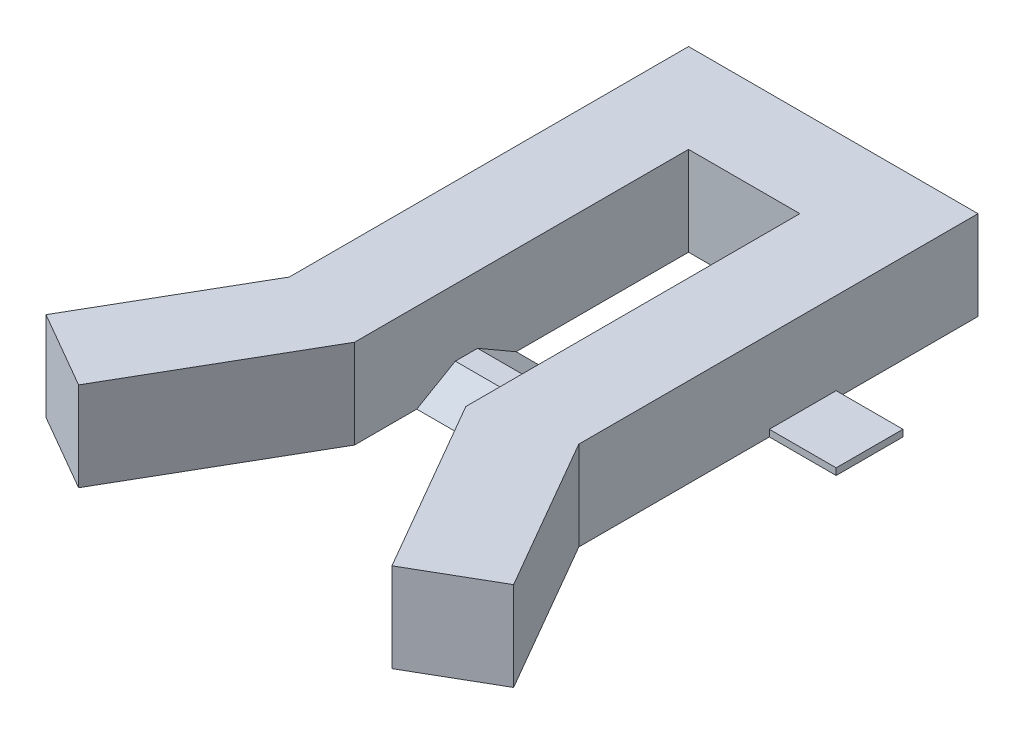
ISO-10303-21;
HEADER;
FILE_DESCRIPTION(('STEP AP214'),'2;1');
FILE_NAME('part.step','',(''),(''),'','','');
FILE_SCHEMA(('AUTOMOTIVE_DESIGN { 1 0 10303 214 1 1 1 1 }'));
ENDSEC;
DATA;
#1=APPLICATION_CONTEXT('core data for automotive mechanical design processes');
#2=APPLICATION_PROTOCOL_DEFINITION('international standard','automotive_design',2000,#1);
#3=PRODUCT_CONTEXT('',#1,'mechanical');
#4=PRODUCT('Part','Part','',(#3));
#5=PRODUCT_RELATED_PRODUCT_CATEGORY('part','',(#4));
#6=PRODUCT_DEFINITION_FORMATION('','',#4);
#7=PRODUCT_DEFINITION_CONTEXT('part definition',#1,'design');
#8=PRODUCT_DEFINITION('design','',#6,#7);
#9=PRODUCT_DEFINITION_SHAPE('','',#8);
#10=(LENGTH_UNIT() NAMED_UNIT(*) SI_UNIT(.MILLI.,.METRE.));
#11=(NAMED_UNIT(*) PLANE_ANGLE_UNIT() SI_UNIT($,.RADIAN.));
#12=(NAMED_UNIT(*) SI_UNIT($,.STERADIAN.) SOLID_ANGLE_UNIT());
#13=UNCERTAINTY_MEASURE_WITH_UNIT(LENGTH_MEASURE(1.E-05),#10,'distance_accuracy_value','');
#14=(GEOMETRIC_REPRESENTATION_CONTEXT(3) GLOBAL_UNCERTAINTY_ASSIGNED_CONTEXT((#13)) GLOBAL_UNIT_ASSIGNED_CONTEXT((#10,
#11,#12)) REPRESENTATION_CONTEXT('',''));
#15=CARTESIAN_POINT('',(0.,0.,0.));
#16=DIRECTION('',(0.,0.,1.));
#17=DIRECTION('',(1.,0.,0.));
#18=AXIS2_PLACEMENT_3D('',#15,#16,#17);
#19=CARTESIAN_POINT('',(-12.5,20.,-75.));
#20=DIRECTION('',(-1.,0.,0.));
#21=DIRECTION('',(0.,0.,1.));
#22=AXIS2_PLACEMENT_3D('',#19,#20,#21);
#23=PLANE('',#22);
#24=DIRECTION('',(0.,0.499999999999994,-0.866025403784442));
#25=VECTOR('',#24,1.);
#26=CARTESIAN_POINT('',(-12.5,5.,-22.6313972081441));
#27=LINE('',#26,#25);
#28=CARTESIAN_POINT('',(-12.5,0.,-13.9711431702996));
#29=VERTEX_POINT('',#28);
#30=CARTESIAN_POINT('',(-12.5,5.,-22.6313972081441));
#31=VERTEX_POINT('',#30);
#32=EDGE_CURVE('E311',#29,#31,#27,.T.);
#33=ORIENTED_EDGE('',*,*,#32,.T.);
#34=DIRECTION('',(0.,0.,-1.));
#35=VECTOR('',#34,1.);
#36=CARTESIAN_POINT('',(-12.5,5.,-27.6313972081441));
#37=LINE('',#36,#35);
#38=CARTESIAN_POINT('',(-12.5,5.00000000000001,-27.6313972081441));
#39=VERTEX_POINT('',#38);
#40=EDGE_CURVE('E307',#31,#39,#37,.T.);
#41=ORIENTED_EDGE('',*,*,#40,.T.);
#42=DIRECTION('',(0.,-0.499999999999995,-0.866025403784441));
#43=VECTOR('',#42,1.);
#44=CARTESIAN_POINT('',(-12.5,0.,-36.2916512459886));
#45=LINE('',#44,#43);
#46=CARTESIAN_POINT('',(-12.5,0.,-36.2916512459886));
#47=VERTEX_POINT('',#46);
#48=EDGE_CURVE('E296',#39,#47,#45,.T.);
#49=ORIENTED_EDGE('',*,*,#48,.T.);
#50=DIRECTION('',(0.,0.,-1.));
#51=VECTOR('',#50,1.);
#52=CARTESIAN_POINT('',(-12.5,0.,-75.));
#53=LINE('',#52,#51);
#54=CARTESIAN_POINT('',(-12.5,0.,-75.));
#55=VERTEX_POINT('',#54);
#56=EDGE_CURVE('E418',#47,#55,#53,.T.);
#57=ORIENTED_EDGE('',*,*,#56,.T.);
#58=DIRECTION('',(0.,-1.,0.));
#59=VECTOR('',#58,1.);
#60=CARTESIAN_POINT('',(-12.5,20.,-75.));
#61=LINE('',#60,#59);
#62=CARTESIAN_POINT('',(-12.5,20.,-75.));
#63=VERTEX_POINT('',#62);
#64=EDGE_CURVE('E446',#63,#55,#61,.T.);
#65=ORIENTED_EDGE('',*,*,#64,.F.);
#66=DIRECTION('',(0.,0.,-1.));
#67=VECTOR('',#66,1.);
#68=CARTESIAN_POINT('',(-12.5,20.,-75.));
#69=LINE('',#68,#67);
#70=CARTESIAN_POINT('',(-12.5,20.,0.));
#71=VERTEX_POINT('',#70);
#72=EDGE_CURVE('E396',#71,#63,#69,.T.);
#73=ORIENTED_EDGE('',*,*,#72,.F.);
#74=DIRECTION('',(0.,-1.,0.));
#75=VECTOR('',#74,1.);
#76=CARTESIAN_POINT('',(-12.5,20.,0.));
#77=LINE('',#76,#75);
#78=CARTESIAN_POINT('',(-12.5,0.,0.));
#79=VERTEX_POINT('',#78);
#80=EDGE_CURVE('E54',#71,#79,#77,.T.);
#81=ORIENTED_EDGE('',*,*,#80,.T.);
#82=EDGE_CURVE('E419',#79,#29,#53,.T.);
#83=ORIENTED_EDGE('',*,*,#82,.T.);
#84=EDGE_LOOP('',(#33,#41,#49,#57,#65,#73,#81,#83));
#85=FACE_BOUND('',#84,.T.);
#86=ADVANCED_FACE('F45',(#85),#23,.F.);
#87=CARTESIAN_POINT('',(12.5,20.,-75.));
#88=DIRECTION('',(-1.,0.,0.));
#89=DIRECTION('',(0.,0.,1.));
#90=AXIS2_PLACEMENT_3D('',#87,#88,#89);
#91=PLANE('',#90);
#92=DIRECTION('',(0.,0.,-1.));
#93=VECTOR('',#92,1.);
#94=CARTESIAN_POINT('',(12.5,5.,-27.6313972081441));
#95=LINE('',#94,#93);
#96=CARTESIAN_POINT('',(12.5,5.,-22.6313972081441));
#97=VERTEX_POINT('',#96);
#98=CARTESIAN_POINT('',(12.5,5.,-27.6313972081441));
#99=VERTEX_POINT('',#98);
#100=EDGE_CURVE('E298',#97,#99,#95,.T.);
#101=ORIENTED_EDGE('',*,*,#100,.F.);
#102=DIRECTION('',(0.,0.499999999999994,-0.866025403784442));
#103=VECTOR('',#102,1.);
#104=CARTESIAN_POINT('',(12.5,5.,-22.6313972081441));
#105=LINE('',#104,#103);
#106=CARTESIAN_POINT('',(12.5,0.,-13.9711431702996));
#107=VERTEX_POINT('',#106);
#108=EDGE_CURVE('E302',#107,#97,#105,.T.);
#109=ORIENTED_EDGE('',*,*,#108,.F.);
#110=DIRECTION('',(0.,0.,-1.));
#111=VECTOR('',#110,1.);
#112=CARTESIAN_POINT('',(12.5,0.,-75.));
#113=LINE('',#112,#111);
#114=CARTESIAN_POINT('',(12.5,0.,0.));
#115=VERTEX_POINT('',#114);
#116=EDGE_CURVE('E360',#115,#107,#113,.T.);
#117=ORIENTED_EDGE('',*,*,#116,.F.);
#118=DIRECTION('',(0.,-1.,0.));
#119=VECTOR('',#118,1.);
#120=CARTESIAN_POINT('',(12.5,20.,0.));
#121=LINE('',#120,#119);
#122=CARTESIAN_POINT('',(12.5,20.,0.));
#123=VERTEX_POINT('',#122);
#124=EDGE_CURVE('E369',#123,#115,#121,.T.);
#125=ORIENTED_EDGE('',*,*,#124,.F.);
#126=DIRECTION('',(0.,0.,-1.));
#127=VECTOR('',#126,1.);
#128=CARTESIAN_POINT('',(12.5,20.,-75.));
#129=LINE('',#128,#127);
#130=CARTESIAN_POINT('',(12.5,20.,-75.));
#131=VERTEX_POINT('',#130);
#132=EDGE_CURVE('E339',#123,#131,#129,.T.);
#133=ORIENTED_EDGE('',*,*,#132,.T.);
#134=DIRECTION('',(0.,-1.,0.));
#135=VECTOR('',#134,1.);
#136=CARTESIAN_POINT('',(12.5,20.,-75.));
#137=LINE('',#136,#135);
#138=CARTESIAN_POINT('',(12.5,0.,-75.));
#139=VERTEX_POINT('',#138);
#140=EDGE_CURVE('E372',#131,#139,#137,.T.);
#141=ORIENTED_EDGE('',*,*,#140,.T.);
#142=CARTESIAN_POINT('',(12.5,0.,-36.2916512459886));
#143=VERTEX_POINT('',#142);
#144=EDGE_CURVE('E359',#143,#139,#113,.T.);
#145=ORIENTED_EDGE('',*,*,#144,.F.);
#146=DIRECTION('',(0.,-0.499999999999995,-0.866025403784441));
#147=VECTOR('',#146,1.);
#148=CARTESIAN_POINT('',(12.5,0.,-36.2916512459886));
#149=LINE('',#148,#147);
#150=EDGE_CURVE('E292',#99,#143,#149,.T.);
#151=ORIENTED_EDGE('',*,*,#150,.F.);
#152=EDGE_LOOP('',(#101,#109,#117,#125,#133,#141,#145,#151));
#153=FACE_BOUND('',#152,.T.);
#154=ADVANCED_FACE('F466',(#153),#91,.T.);
#155=CARTESIAN_POINT('',(-52.4999999999998,20.,29.2820323027553));
#156=DIRECTION('',(0.499999999999994,0.,-0.866025403784442));
#157=DIRECTION('',(-0.866025403784442,0.,-0.499999999999994));
#158=AXIS2_PLACEMENT_3D('',#155,#156,#157);
#159=PLANE('',#158);
#160=DIRECTION('',(0.866025403784442,0.,0.499999999999994));
#161=VECTOR('',#160,1.);
#162=CARTESIAN_POINT('',(-52.4999999999998,0.,29.2820323027553));
#163=LINE('',#162,#161);
#164=CARTESIAN_POINT('',(-52.4999999999998,0.,29.2820323027553));
#165=VERTEX_POINT('',#164);
#166=CARTESIAN_POINT('',(-35.1794919243109,0.,39.2820323027552));
#167=VERTEX_POINT('',#166);
#168=EDGE_CURVE('E387',#165,#167,#163,.T.);
#169=ORIENTED_EDGE('',*,*,#168,.T.);
#170=DIRECTION('',(0.,-1.,0.));
#171=VECTOR('',#170,1.);
#172=CARTESIAN_POINT('',(-35.1794919243109,20.,39.2820323027552));
#173=LINE('',#172,#171);
#174=CARTESIAN_POINT('',(-35.1794919243109,20.,39.2820323027552));
#175=VERTEX_POINT('',#174);
#176=EDGE_CURVE('E11',#175,#167,#173,.T.);
#177=ORIENTED_EDGE('',*,*,#176,.F.);
#178=DIRECTION('',(0.866025403784442,0.,0.499999999999994));
#179=VECTOR('',#178,1.);
#180=CARTESIAN_POINT('',(-52.4999999999998,20.,29.2820323027553));
#181=LINE('',#180,#179);
#182=CARTESIAN_POINT('',(-52.4999999999998,20.,29.2820323027553));
#183=VERTEX_POINT('',#182);
#184=EDGE_CURVE('E388',#183,#175,#181,.T.);
#185=ORIENTED_EDGE('',*,*,#184,.F.);
#186=DIRECTION('',(0.,-1.,0.));
#187=VECTOR('',#186,1.);
#188=CARTESIAN_POINT('',(-52.4999999999998,20.,29.2820323027553));
#189=LINE('',#188,#187);
#190=EDGE_CURVE('E411',#183,#165,#189,.T.);
#191=ORIENTED_EDGE('',*,*,#190,.T.);
#192=EDGE_LOOP('',(#169,#177,#185,#191));
#193=FACE_BOUND('',#192,.T.);
#194=ADVANCED_FACE('F47',(#193),#159,.F.);
#195=CARTESIAN_POINT('',(-35.1794919243109,20.,39.2820323027552));
#196=DIRECTION('',(-0.866025403784442,0.,-0.499999999999994));
#197=DIRECTION('',(-0.499999999999994,0.,0.866025403784442));
#198=AXIS2_PLACEMENT_3D('',#195,#196,#197);
#199=PLANE('',#198);
#200=DIRECTION('',(0.499999999999994,0.,-0.866025403784442));
#201=VECTOR('',#200,1.);
#202=CARTESIAN_POINT('',(-35.1794919243109,0.,39.2820323027552));
#203=LINE('',#202,#201);
#204=EDGE_CURVE('E415',#167,#79,#203,.T.);
#205=ORIENTED_EDGE('',*,*,#204,.T.);
#206=ORIENTED_EDGE('',*,*,#80,.F.);
#207=DIRECTION('',(0.499999999999994,0.,-0.866025403784442));
#208=VECTOR('',#207,1.);
#209=CARTESIAN_POINT('',(-35.1794919243109,20.,39.2820323027552));
#210=LINE('',#209,#208);
#211=EDGE_CURVE('E392',#175,#71,#210,.T.);
#212=ORIENTED_EDGE('',*,*,#211,.F.);
#213=ORIENTED_EDGE('',*,*,#176,.T.);
#214=EDGE_LOOP('',(#205,#206,#212,#213));
#215=FACE_BOUND('',#214,.T.);
#216=ADVANCED_FACE('F506',(#215),#199,.F.);
#217=CARTESIAN_POINT('',(0.,20.,-75.));
#218=DIRECTION('',(0.,0.,-1.));
#219=DIRECTION('',(-1.,0.,0.));
#220=AXIS2_PLACEMENT_3D('',#217,#218,#219);
#221=PLANE('',#220);
#222=DIRECTION('',(1.,0.,0.));
#223=VECTOR('',#222,1.);
#224=CARTESIAN_POINT('',(0.,0.,-75.));
#225=LINE('',#224,#223);
#226=EDGE_CURVE('E422',#55,#139,#225,.T.);
#227=ORIENTED_EDGE('',*,*,#226,.T.);
#228=ORIENTED_EDGE('',*,*,#140,.F.);
#229=DIRECTION('',(1.,0.,0.));
#230=VECTOR('',#229,1.);
#231=CARTESIAN_POINT('',(0.,20.,-75.));
#232=LINE('',#231,#230);
#233=EDGE_CURVE('E399',#63,#131,#232,.T.);
#234=ORIENTED_EDGE('',*,*,#233,.F.);
#235=ORIENTED_EDGE('',*,*,#64,.T.);
#236=EDGE_LOOP('',(#227,#228,#234,#235));
#237=FACE_BOUND('',#236,.T.);
#238=ADVANCED_FACE('F481',(#237),#221,.F.);
#239=CARTESIAN_POINT('',(-32.5,20.,-95.));
#240=DIRECTION('',(0.,0.,1.));
#241=DIRECTION('',(1.,0.,0.));
#242=AXIS2_PLACEMENT_3D('',#239,#240,#241);
#243=PLANE('',#242);
#244=DIRECTION('',(-1.,0.,0.));
#245=VECTOR('',#244,1.);
#246=CARTESIAN_POINT('',(-32.5,0.,-95.));
#247=LINE('',#246,#245);
#248=CARTESIAN_POINT('',(32.5,0.,-95.));
#249=VERTEX_POINT('',#248);
#250=CARTESIAN_POINT('',(-32.5,0.,-95.));
#251=VERTEX_POINT('',#250);
#252=EDGE_CURVE('E426',#249,#251,#247,.T.);
#253=ORIENTED_EDGE('',*,*,#252,.T.);
#254=DIRECTION('',(0.,-1.,0.));
#255=VECTOR('',#254,1.);
#256=CARTESIAN_POINT('',(-32.5,20.,-95.));
#257=LINE('',#256,#255);
#258=CARTESIAN_POINT('',(-32.5,20.,-95.));
#259=VERTEX_POINT('',#258);
#260=EDGE_CURVE('E442',#259,#251,#257,.T.);
#261=ORIENTED_EDGE('',*,*,#260,.F.);
#262=DIRECTION('',(-1.,0.,0.));
#263=VECTOR('',#262,1.);
#264=CARTESIAN_POINT('',(-32.5,20.,-95.));
#265=LINE('',#264,#263);
#266=CARTESIAN_POINT('',(32.5,20.,-95.));
#267=VERTEX_POINT('',#266);
#268=EDGE_CURVE('E402',#267,#259,#265,.T.);
#269=ORIENTED_EDGE('',*,*,#268,.F.);
#270=DIRECTION('',(0.,-1.,0.));
#271=VECTOR('',#270,1.);
#272=CARTESIAN_POINT('',(32.5,20.,-95.));
#273=LINE('',#272,#271);
#274=EDGE_CURVE('E376',#267,#249,#273,.T.);
#275=ORIENTED_EDGE('',*,*,#274,.T.);
#276=EDGE_LOOP('',(#253,#261,#269,#275));
#277=FACE_BOUND('',#276,.T.);
#278=ADVANCED_FACE('F555',(#277),#243,.F.);
#279=CARTESIAN_POINT('',(-32.5,20.,-95.));
#280=DIRECTION('',(1.,0.,0.));
#281=DIRECTION('',(0.,0.,-1.));
#282=AXIS2_PLACEMENT_3D('',#279,#280,#281);
#283=PLANE('',#282);
#284=DIRECTION('',(0.,0.,1.));
#285=VECTOR('',#284,1.);
#286=CARTESIAN_POINT('',(-32.5,0.,-95.));
#287=LINE('',#286,#285);
#288=CARTESIAN_POINT('',(-32.5,0.,-63.1458256229943));
#289=VERTEX_POINT('',#288);
#290=EDGE_CURVE('E430',#251,#289,#287,.T.);
#291=ORIENTED_EDGE('',*,*,#290,.T.);
#292=DIRECTION('',(0.,-1.,0.));
#293=VECTOR('',#292,1.);
#294=CARTESIAN_POINT('',(-32.5,1.5,-63.1458256229943));
#295=LINE('',#294,#293);
#296=CARTESIAN_POINT('',(-32.5,1.5,-63.1458256229943));
#297=VERTEX_POINT('',#296);
#298=EDGE_CURVE('E279',#297,#289,#295,.T.);
#299=ORIENTED_EDGE('',*,*,#298,.F.);
#300=DIRECTION('',(0.,0.,1.));
#301=VECTOR('',#300,1.);
#302=CARTESIAN_POINT('',(-32.5,1.5,-48.1458256229943));
#303=LINE('',#302,#301);
#304=CARTESIAN_POINT('',(-32.5,1.5,-48.1458256229943));
#305=VERTEX_POINT('',#304);
#306=EDGE_CURVE('E69',#297,#305,#303,.T.);
#307=ORIENTED_EDGE('',*,*,#306,.T.);
#308=DIRECTION('',(0.,-1.,0.));
#309=VECTOR('',#308,1.);
#310=CARTESIAN_POINT('',(-32.5,1.5,-48.1458256229943));
#311=LINE('',#310,#309);
#312=CARTESIAN_POINT('',(-32.5,0.,-48.1458256229943));
#313=VERTEX_POINT('',#312);
#314=EDGE_CURVE('E268',#305,#313,#311,.T.);
#315=ORIENTED_EDGE('',*,*,#314,.T.);
#316=CARTESIAN_POINT('',(-32.5,0.,-5.35898384862239));
#317=VERTEX_POINT('',#316);
#318=EDGE_CURVE('E429',#313,#317,#287,.T.);
#319=ORIENTED_EDGE('',*,*,#318,.T.);
#320=DIRECTION('',(0.,-1.,0.));
#321=VECTOR('',#320,1.);
#322=CARTESIAN_POINT('',(-32.5,20.,-5.35898384862239));
#323=LINE('',#322,#321);
#324=CARTESIAN_POINT('',(-32.5,20.,-5.35898384862239));
#325=VERTEX_POINT('',#324);
#326=EDGE_CURVE('E438',#325,#317,#323,.T.);
#327=ORIENTED_EDGE('',*,*,#326,.F.);
#328=DIRECTION('',(0.,0.,1.));
#329=VECTOR('',#328,1.);
#330=CARTESIAN_POINT('',(-32.5,20.,-95.));
#331=LINE('',#330,#329);
#332=EDGE_CURVE('E405',#259,#325,#331,.T.);
#333=ORIENTED_EDGE('',*,*,#332,.F.);
#334=ORIENTED_EDGE('',*,*,#260,.T.);
#335=EDGE_LOOP('',(#291,#299,#307,#315,#319,#327,#333,#334));
#336=FACE_BOUND('',#335,.T.);
#337=ADVANCED_FACE('F515',(#336),#283,.F.);
#338=CARTESIAN_POINT('',(-32.5,20.,-5.35898384862239));
#339=DIRECTION('',(0.866025403784442,0.,0.499999999999995));
#340=DIRECTION('',(0.499999999999995,0.,-0.866025403784442));
#341=AXIS2_PLACEMENT_3D('',#338,#339,#340);
#342=PLANE('',#341);
#343=DIRECTION('',(-0.499999999999995,0.,0.866025403784442));
#344=VECTOR('',#343,1.);
#345=CARTESIAN_POINT('',(-32.5,0.,-5.35898384862239));
#346=LINE('',#345,#344);
#347=EDGE_CURVE('E393',#317,#165,#346,.T.);
#348=ORIENTED_EDGE('',*,*,#347,.T.);
#349=ORIENTED_EDGE('',*,*,#190,.F.);
#350=DIRECTION('',(-0.499999999999995,0.,0.866025403784442));
#351=VECTOR('',#350,1.);
#352=CARTESIAN_POINT('',(-32.5,20.,-5.35898384862239));
#353=LINE('',#352,#351);
#354=EDGE_CURVE('E408',#325,#183,#353,.T.);
#355=ORIENTED_EDGE('',*,*,#354,.F.);
#356=ORIENTED_EDGE('',*,*,#326,.T.);
#357=EDGE_LOOP('',(#348,#349,#355,#356));
#358=FACE_BOUND('',#357,.T.);
#359=ADVANCED_FACE('F511',(#358),#342,.F.);
#360=CARTESIAN_POINT('',(0.,20.,0.));
#361=DIRECTION('',(0.,1.,0.));
#362=DIRECTION('',(0.,0.,1.));
#363=AXIS2_PLACEMENT_3D('',#360,#361,#362);
#364=PLANE('',#363);
#365=ORIENTED_EDGE('',*,*,#184,.T.);
#366=ORIENTED_EDGE('',*,*,#211,.T.);
#367=ORIENTED_EDGE('',*,*,#72,.T.);
#368=ORIENTED_EDGE('',*,*,#233,.T.);
#369=ORIENTED_EDGE('',*,*,#132,.F.);
#370=DIRECTION('',(-0.499999999999994,0.,-0.866025403784442));
#371=VECTOR('',#370,1.);
#372=CARTESIAN_POINT('',(35.1794919243109,20.,39.2820323027552));
#373=LINE('',#372,#371);
#374=CARTESIAN_POINT('',(35.1794919243109,20.,39.2820323027552));
#375=VERTEX_POINT('',#374);
#376=EDGE_CURVE('E343',#375,#123,#373,.T.);
#377=ORIENTED_EDGE('',*,*,#376,.F.);
#378=DIRECTION('',(-0.866025403784442,0.,0.499999999999994));
#379=VECTOR('',#378,1.);
#380=CARTESIAN_POINT('',(52.4999999999998,20.,29.2820323027553));
#381=LINE('',#380,#379);
#382=CARTESIAN_POINT('',(52.4999999999998,20.,29.2820323027553));
#383=VERTEX_POINT('',#382);
#384=EDGE_CURVE('E326',#383,#375,#381,.T.);
#385=ORIENTED_EDGE('',*,*,#384,.F.);
#386=DIRECTION('',(0.499999999999995,0.,0.866025403784442));
#387=VECTOR('',#386,1.);
#388=CARTESIAN_POINT('',(32.5,20.,-5.35898384862239));
#389=LINE('',#388,#387);
#390=CARTESIAN_POINT('',(32.5,20.,-5.35898384862239));
#391=VERTEX_POINT('',#390);
#392=EDGE_CURVE('E330',#391,#383,#389,.T.);
#393=ORIENTED_EDGE('',*,*,#392,.F.);
#394=DIRECTION('',(0.,0.,1.));
#395=VECTOR('',#394,1.);
#396=CARTESIAN_POINT('',(32.5,20.,-95.));
#397=LINE('',#396,#395);
#398=EDGE_CURVE('E335',#267,#391,#397,.T.);
#399=ORIENTED_EDGE('',*,*,#398,.F.);
#400=ORIENTED_EDGE('',*,*,#268,.T.);
#401=ORIENTED_EDGE('',*,*,#332,.T.);
#402=ORIENTED_EDGE('',*,*,#354,.T.);
#403=EDGE_LOOP('',(#365,#366,#367,#368,#369,#377,#385,#393,#399,#400,#401,#402));
#404=FACE_BOUND('',#403,.T.);
#405=ADVANCED_FACE('F503',(#404),#364,.T.);
#406=CARTESIAN_POINT('',(0.,0.,0.));
#407=DIRECTION('',(0.,1.,0.));
#408=DIRECTION('',(0.,0.,1.));
#409=AXIS2_PLACEMENT_3D('',#406,#407,#408);
#410=PLANE('',#409);
#411=DIRECTION('',(1.,0.,0.));
#412=VECTOR('',#411,1.);
#413=CARTESIAN_POINT('',(-35.3736765902838,0.,-13.9711431702996));
#414=LINE('',#413,#412);
#415=EDGE_CURVE('E306',#29,#107,#414,.T.);
#416=ORIENTED_EDGE('',*,*,#415,.F.);
#417=ORIENTED_EDGE('',*,*,#82,.F.);
#418=ORIENTED_EDGE('',*,*,#204,.F.);
#419=ORIENTED_EDGE('',*,*,#168,.F.);
#420=ORIENTED_EDGE('',*,*,#347,.F.);
#421=ORIENTED_EDGE('',*,*,#318,.F.);
#422=DIRECTION('',(-1.,0.,0.));
#423=VECTOR('',#422,1.);
#424=CARTESIAN_POINT('',(-32.5,0.,-48.1458256229943));
#425=LINE('',#424,#423);
#426=CARTESIAN_POINT('',(-47.5,0.,-48.1458256229943));
#427=VERTEX_POINT('',#426);
#428=EDGE_CURVE('E243',#313,#427,#425,.T.);
#429=ORIENTED_EDGE('',*,*,#428,.T.);
#430=DIRECTION('',(0.,0.,-1.));
#431=VECTOR('',#430,1.);
#432=CARTESIAN_POINT('',(-47.5,0.,-48.1458256229943));
#433=LINE('',#432,#431);
#434=CARTESIAN_POINT('',(-47.5,0.,-63.1458256229943));
#435=VERTEX_POINT('',#434);
#436=EDGE_CURVE('E272',#427,#435,#433,.T.);
#437=ORIENTED_EDGE('',*,*,#436,.T.);
#438=DIRECTION('',(1.,0.,0.));
#439=VECTOR('',#438,1.);
#440=CARTESIAN_POINT('',(-32.5,0.,-63.1458256229943));
#441=LINE('',#440,#439);
#442=EDGE_CURVE('E256',#435,#289,#441,.T.);
#443=ORIENTED_EDGE('',*,*,#442,.T.);
#444=ORIENTED_EDGE('',*,*,#290,.F.);
#445=ORIENTED_EDGE('',*,*,#252,.F.);
#446=DIRECTION('',(0.,0.,1.));
#447=VECTOR('',#446,1.);
#448=CARTESIAN_POINT('',(32.5,0.,-95.));
#449=LINE('',#448,#447);
#450=CARTESIAN_POINT('',(32.5,0.,-63.1458256229943));
#451=VERTEX_POINT('',#450);
#452=EDGE_CURVE('E356',#249,#451,#449,.T.);
#453=ORIENTED_EDGE('',*,*,#452,.T.);
#454=DIRECTION('',(1.,0.,0.));
#455=VECTOR('',#454,1.);
#456=CARTESIAN_POINT('',(32.5,0.,-63.1458256229943));
#457=LINE('',#456,#455);
#458=CARTESIAN_POINT('',(47.5,0.,-63.1458256229943));
#459=VERTEX_POINT('',#458);
#460=EDGE_CURVE('E226',#451,#459,#457,.T.);
#461=ORIENTED_EDGE('',*,*,#460,.T.);
#462=DIRECTION('',(0.,0.,1.));
#463=VECTOR('',#462,1.);
#464=CARTESIAN_POINT('',(47.5,0.,-48.1458256229943));
#465=LINE('',#464,#463);
#466=CARTESIAN_POINT('',(47.5,0.,-48.1458256229943));
#467=VERTEX_POINT('',#466);
#468=EDGE_CURVE('E211',#459,#467,#465,.T.);
#469=ORIENTED_EDGE('',*,*,#468,.T.);
#470=DIRECTION('',(-1.,0.,0.));
#471=VECTOR('',#470,1.);
#472=CARTESIAN_POINT('',(32.5,0.,-48.1458256229943));
#473=LINE('',#472,#471);
#474=CARTESIAN_POINT('',(32.5,0.,-48.1458256229943));
#475=VERTEX_POINT('',#474);
#476=EDGE_CURVE('E61',#467,#475,#473,.T.);
#477=ORIENTED_EDGE('',*,*,#476,.T.);
#478=CARTESIAN_POINT('',(32.5,0.,-5.35898384862239));
#479=VERTEX_POINT('',#478);
#480=EDGE_CURVE('E355',#475,#479,#449,.T.);
#481=ORIENTED_EDGE('',*,*,#480,.T.);
#482=DIRECTION('',(0.499999999999995,0.,0.866025403784442));
#483=VECTOR('',#482,1.);
#484=CARTESIAN_POINT('',(32.5,0.,-5.35898384862239));
#485=LINE('',#484,#483);
#486=CARTESIAN_POINT('',(52.4999999999998,0.,29.2820323027553));
#487=VERTEX_POINT('',#486);
#488=EDGE_CURVE('E351',#479,#487,#485,.T.);
#489=ORIENTED_EDGE('',*,*,#488,.T.);
#490=DIRECTION('',(-0.866025403784442,0.,0.499999999999994));
#491=VECTOR('',#490,1.);
#492=CARTESIAN_POINT('',(52.4999999999998,0.,29.2820323027553));
#493=LINE('',#492,#491);
#494=CARTESIAN_POINT('',(35.1794919243109,0.,39.2820323027552));
#495=VERTEX_POINT('',#494);
#496=EDGE_CURVE('E310',#487,#495,#493,.T.);
#497=ORIENTED_EDGE('',*,*,#496,.T.);
#498=DIRECTION('',(-0.499999999999994,0.,-0.866025403784442));
#499=VECTOR('',#498,1.);
#500=CARTESIAN_POINT('',(35.1794919243109,0.,39.2820323027552));
#501=LINE('',#500,#499);
#502=EDGE_CURVE('E331',#495,#115,#501,.T.);
#503=ORIENTED_EDGE('',*,*,#502,.T.);
#504=ORIENTED_EDGE('',*,*,#116,.T.);
#505=EDGE_LOOP('',(#416,#417,#418,#419,#420,#421,#429,#437,#443,#444,#445,#453,#461,#469,#477,
#481,#489,#497,#503,#504));
#506=FACE_BOUND('',#505,.T.);
#507=ORIENTED_EDGE('',*,*,#56,.F.);
#508=DIRECTION('',(1.,0.,0.));
#509=VECTOR('',#508,1.);
#510=CARTESIAN_POINT('',(-35.3736765902838,0.,-36.2916512459886));
#511=LINE('',#510,#509);
#512=EDGE_CURVE('E283',#47,#143,#511,.T.);
#513=ORIENTED_EDGE('',*,*,#512,.T.);
#514=ORIENTED_EDGE('',*,*,#144,.T.);
#515=ORIENTED_EDGE('',*,*,#226,.F.);
#516=EDGE_LOOP('',(#507,#513,#514,#515));
#517=FACE_BOUND('',#516,.T.);
#518=ADVANCED_FACE('F223',(#506,#517),#410,.F.);
#519=CARTESIAN_POINT('',(52.4999999999998,20.,29.2820323027553));
#520=DIRECTION('',(0.499999999999994,0.,0.866025403784442));
#521=DIRECTION('',(0.866025403784442,0.,-0.499999999999994));
#522=AXIS2_PLACEMENT_3D('',#519,#520,#521);
#523=PLANE('',#522);
#524=ORIENTED_EDGE('',*,*,#496,.F.);
#525=DIRECTION('',(0.,-1.,0.));
#526=VECTOR('',#525,1.);
#527=CARTESIAN_POINT('',(52.4999999999998,20.,29.2820323027553));
#528=LINE('',#527,#526);
#529=EDGE_CURVE('E384',#383,#487,#528,.T.);
#530=ORIENTED_EDGE('',*,*,#529,.F.);
#531=ORIENTED_EDGE('',*,*,#384,.T.);
#532=DIRECTION('',(0.,-1.,0.));
#533=VECTOR('',#532,1.);
#534=CARTESIAN_POINT('',(35.1794919243109,20.,39.2820323027552));
#535=LINE('',#534,#533);
#536=EDGE_CURVE('E347',#375,#495,#535,.T.);
#537=ORIENTED_EDGE('',*,*,#536,.T.);
#538=EDGE_LOOP('',(#524,#530,#531,#537));
#539=FACE_BOUND('',#538,.T.);
#540=ADVANCED_FACE('F496',(#539),#523,.T.);
#541=CARTESIAN_POINT('',(32.5,20.,-5.35898384862239));
#542=DIRECTION('',(0.866025403784442,0.,-0.499999999999995));
#543=DIRECTION('',(-0.499999999999995,0.,-0.866025403784442));
#544=AXIS2_PLACEMENT_3D('',#541,#542,#543);
#545=PLANE('',#544);
#546=ORIENTED_EDGE('',*,*,#488,.F.);
#547=DIRECTION('',(0.,-1.,0.));
#548=VECTOR('',#547,1.);
#549=CARTESIAN_POINT('',(32.5,20.,-5.35898384862239));
#550=LINE('',#549,#548);
#551=EDGE_CURVE('E380',#391,#479,#550,.T.);
#552=ORIENTED_EDGE('',*,*,#551,.F.);
#553=ORIENTED_EDGE('',*,*,#392,.T.);
#554=ORIENTED_EDGE('',*,*,#529,.T.);
#555=EDGE_LOOP('',(#546,#552,#553,#554));
#556=FACE_BOUND('',#555,.T.);
#557=ADVANCED_FACE('F492',(#556),#545,.T.);
#558=CARTESIAN_POINT('',(32.5,20.,-95.));
#559=DIRECTION('',(1.,0.,0.));
#560=DIRECTION('',(0.,0.,-1.));
#561=AXIS2_PLACEMENT_3D('',#558,#559,#560);
#562=PLANE('',#561);
#563=DIRECTION('',(0.,-1.,0.));
#564=VECTOR('',#563,1.);
#565=CARTESIAN_POINT('',(32.5,1.5,-48.1458256229943));
#566=LINE('',#565,#564);
#567=CARTESIAN_POINT('',(32.5,1.5,-48.1458256229943));
#568=VERTEX_POINT('',#567);
#569=EDGE_CURVE('E220',#568,#475,#566,.T.);
#570=ORIENTED_EDGE('',*,*,#569,.F.);
#571=DIRECTION('',(0.,0.,-1.));
#572=VECTOR('',#571,1.);
#573=CARTESIAN_POINT('',(32.5,1.5,-48.1458256229943));
#574=LINE('',#573,#572);
#575=CARTESIAN_POINT('',(32.5,1.5,-63.1458256229943));
#576=VERTEX_POINT('',#575);
#577=EDGE_CURVE('E233',#568,#576,#574,.T.);
#578=ORIENTED_EDGE('',*,*,#577,.T.);
#579=DIRECTION('',(0.,-1.,0.));
#580=VECTOR('',#579,1.);
#581=CARTESIAN_POINT('',(32.5,1.5,-63.1458256229943));
#582=LINE('',#581,#580);
#583=EDGE_CURVE('E247',#576,#451,#582,.T.);
#584=ORIENTED_EDGE('',*,*,#583,.T.);
#585=ORIENTED_EDGE('',*,*,#452,.F.);
#586=ORIENTED_EDGE('',*,*,#274,.F.);
#587=ORIENTED_EDGE('',*,*,#398,.T.);
#588=ORIENTED_EDGE('',*,*,#551,.T.);
#589=ORIENTED_EDGE('',*,*,#480,.F.);
#590=EDGE_LOOP('',(#570,#578,#584,#585,#586,#587,#588,#589));
#591=FACE_BOUND('',#590,.T.);
#592=ADVANCED_FACE('F487',(#591),#562,.T.);
#593=CARTESIAN_POINT('',(35.1794919243109,20.,39.2820323027552));
#594=DIRECTION('',(-0.866025403784442,0.,0.499999999999994));
#595=DIRECTION('',(0.499999999999994,0.,0.866025403784442));
#596=AXIS2_PLACEMENT_3D('',#593,#594,#595);
#597=PLANE('',#596);
#598=ORIENTED_EDGE('',*,*,#502,.F.);
#599=ORIENTED_EDGE('',*,*,#536,.F.);
#600=ORIENTED_EDGE('',*,*,#376,.T.);
#601=ORIENTED_EDGE('',*,*,#124,.T.);
#602=EDGE_LOOP('',(#598,#599,#600,#601));
#603=FACE_BOUND('',#602,.T.);
#604=ADVANCED_FACE('F499',(#603),#597,.T.);
#605=CARTESIAN_POINT('',(-35.3736765902838,5.,-22.6313972081441));
#606=DIRECTION('',(0.,-0.866025403784442,-0.499999999999994));
#607=DIRECTION('',(0.,0.499999999999994,-0.866025403784442));
#608=AXIS2_PLACEMENT_3D('',#605,#606,#607);
#609=PLANE('',#608);
#610=ORIENTED_EDGE('',*,*,#32,.F.);
#611=ORIENTED_EDGE('',*,*,#415,.T.);
#612=ORIENTED_EDGE('',*,*,#108,.T.);
#613=DIRECTION('',(1.,0.,0.));
#614=VECTOR('',#613,1.);
#615=CARTESIAN_POINT('',(-35.3736765902838,5.,-22.6313972081441));
#616=LINE('',#615,#614);
#617=EDGE_CURVE('E301',#31,#97,#616,.T.);
#618=ORIENTED_EDGE('',*,*,#617,.F.);
#619=EDGE_LOOP('',(#610,#611,#612,#618));
#620=FACE_BOUND('',#619,.T.);
#621=ADVANCED_FACE('F462',(#620),#609,.F.);
#622=CARTESIAN_POINT('',(-35.3736765902838,5.,-27.6313972081441));
#623=DIRECTION('',(0.,-1.,0.));
#624=DIRECTION('',(0.,0.,-1.));
#625=AXIS2_PLACEMENT_3D('',#622,#623,#624);
#626=PLANE('',#625);
#627=ORIENTED_EDGE('',*,*,#40,.F.);
#628=ORIENTED_EDGE('',*,*,#617,.T.);
#629=ORIENTED_EDGE('',*,*,#100,.T.);
#630=DIRECTION('',(1.,0.,0.));
#631=VECTOR('',#630,1.);
#632=CARTESIAN_POINT('',(-35.3736765902838,5.,-27.6313972081441));
#633=LINE('',#632,#631);
#634=EDGE_CURVE('E297',#39,#99,#633,.T.);
#635=ORIENTED_EDGE('',*,*,#634,.F.);
#636=EDGE_LOOP('',(#627,#628,#629,#635));
#637=FACE_BOUND('',#636,.T.);
#638=ADVANCED_FACE('F472',(#637),#626,.F.);
#639=CARTESIAN_POINT('',(-35.3736765902838,0.,-36.2916512459886));
#640=DIRECTION('',(0.,-0.866025403784441,0.499999999999995));
#641=DIRECTION('',(0.,-0.499999999999995,-0.866025403784441));
#642=AXIS2_PLACEMENT_3D('',#639,#640,#641);
#643=PLANE('',#642);
#644=ORIENTED_EDGE('',*,*,#48,.F.);
#645=ORIENTED_EDGE('',*,*,#634,.T.);
#646=ORIENTED_EDGE('',*,*,#150,.T.);
#647=ORIENTED_EDGE('',*,*,#512,.F.);
#648=EDGE_LOOP('',(#644,#645,#646,#647));
#649=FACE_BOUND('',#648,.T.);
#650=ADVANCED_FACE('F475',(#649),#643,.F.);
#651=CARTESIAN_POINT('',(-32.5,1.5,-63.1458256229943));
#652=DIRECTION('',(0.,0.,-1.));
#653=DIRECTION('',(-1.,0.,0.));
#654=AXIS2_PLACEMENT_3D('',#651,#652,#653);
#655=PLANE('',#654);
#656=ORIENTED_EDGE('',*,*,#442,.F.);
#657=DIRECTION('',(0.,-1.,0.));
#658=VECTOR('',#657,1.);
#659=CARTESIAN_POINT('',(-47.5,1.5,-63.1458256229943));
#660=LINE('',#659,#658);
#661=CARTESIAN_POINT('',(-47.5,1.5,-63.1458256229943));
#662=VERTEX_POINT('',#661);
#663=EDGE_CURVE('E284',#662,#435,#660,.T.);
#664=ORIENTED_EDGE('',*,*,#663,.F.);
#665=DIRECTION('',(1.,0.,0.));
#666=VECTOR('',#665,1.);
#667=CARTESIAN_POINT('',(-32.5,1.5,-63.1458256229943));
#668=LINE('',#667,#666);
#669=EDGE_CURVE('E264',#662,#297,#668,.T.);
#670=ORIENTED_EDGE('',*,*,#669,.T.);
#671=ORIENTED_EDGE('',*,*,#298,.T.);
#672=EDGE_LOOP('',(#656,#664,#670,#671));
#673=FACE_BOUND('',#672,.T.);
#674=ADVANCED_FACE('F526',(#673),#655,.T.);
#675=CARTESIAN_POINT('',(-47.5,1.5,-48.1458256229943));
#676=DIRECTION('',(-1.,0.,0.));
#677=DIRECTION('',(0.,0.,1.));
#678=AXIS2_PLACEMENT_3D('',#675,#676,#677);
#679=PLANE('',#678);
#680=ORIENTED_EDGE('',*,*,#436,.F.);
#681=DIRECTION('',(0.,-1.,0.));
#682=VECTOR('',#681,1.);
#683=CARTESIAN_POINT('',(-47.5,1.5,-48.1458256229943));
#684=LINE('',#683,#682);
#685=CARTESIAN_POINT('',(-47.5,1.5,-48.1458256229943));
#686=VERTEX_POINT('',#685);
#687=EDGE_CURVE('E287',#686,#427,#684,.T.);
#688=ORIENTED_EDGE('',*,*,#687,.F.);
#689=DIRECTION('',(0.,0.,-1.));
#690=VECTOR('',#689,1.);
#691=CARTESIAN_POINT('',(-47.5,1.5,-48.1458256229943));
#692=LINE('',#691,#690);
#693=EDGE_CURVE('E260',#686,#662,#692,.T.);
#694=ORIENTED_EDGE('',*,*,#693,.T.);
#695=ORIENTED_EDGE('',*,*,#663,.T.);
#696=EDGE_LOOP('',(#680,#688,#694,#695));
#697=FACE_BOUND('',#696,.T.);
#698=ADVANCED_FACE('F531',(#697),#679,.T.);
#699=CARTESIAN_POINT('',(-32.5,1.5,-48.1458256229943));
#700=DIRECTION('',(0.,0.,1.));
#701=DIRECTION('',(1.,0.,0.));
#702=AXIS2_PLACEMENT_3D('',#699,#700,#701);
#703=PLANE('',#702);
#704=ORIENTED_EDGE('',*,*,#428,.F.);
#705=ORIENTED_EDGE('',*,*,#314,.F.);
#706=DIRECTION('',(-1.,0.,0.));
#707=VECTOR('',#706,1.);
#708=CARTESIAN_POINT('',(-32.5,1.5,-48.1458256229943));
#709=LINE('',#708,#707);
#710=EDGE_CURVE('E255',#305,#686,#709,.T.);
#711=ORIENTED_EDGE('',*,*,#710,.T.);
#712=ORIENTED_EDGE('',*,*,#687,.T.);
#713=EDGE_LOOP('',(#704,#705,#711,#712));
#714=FACE_BOUND('',#713,.T.);
#715=ADVANCED_FACE('F520',(#714),#703,.T.);
#716=CARTESIAN_POINT('',(0.,1.5,0.));
#717=DIRECTION('',(0.,1.,0.));
#718=DIRECTION('',(0.,0.,1.));
#719=AXIS2_PLACEMENT_3D('',#716,#717,#718);
#720=PLANE('',#719);
#721=ORIENTED_EDGE('',*,*,#306,.F.);
#722=ORIENTED_EDGE('',*,*,#669,.F.);
#723=ORIENTED_EDGE('',*,*,#693,.F.);
#724=ORIENTED_EDGE('',*,*,#710,.F.);
#725=EDGE_LOOP('',(#721,#722,#723,#724));
#726=FACE_BOUND('',#725,.T.);
#727=ADVANCED_FACE('F529',(#726),#720,.T.);
#728=CARTESIAN_POINT('',(32.5,1.5,-48.1458256229943));
#729=DIRECTION('',(0.,0.,1.));
#730=DIRECTION('',(1.,0.,0.));
#731=AXIS2_PLACEMENT_3D('',#728,#729,#730);
#732=PLANE('',#731);
#733=ORIENTED_EDGE('',*,*,#476,.F.);
#734=DIRECTION('',(0.,-1.,0.));
#735=VECTOR('',#734,1.);
#736=CARTESIAN_POINT('',(47.5,1.5,-48.1458256229943));
#737=LINE('',#736,#735);
#738=CARTESIAN_POINT('',(47.5,1.5,-48.1458256229943));
#739=VERTEX_POINT('',#738);
#740=EDGE_CURVE('E209',#739,#467,#737,.T.);
#741=ORIENTED_EDGE('',*,*,#740,.F.);
#742=DIRECTION('',(-1.,0.,0.));
#743=VECTOR('',#742,1.);
#744=CARTESIAN_POINT('',(32.5,1.5,-48.1458256229943));
#745=LINE('',#744,#743);
#746=EDGE_CURVE('E244',#739,#568,#745,.T.);
#747=ORIENTED_EDGE('',*,*,#746,.T.);
#748=ORIENTED_EDGE('',*,*,#569,.T.);
#749=EDGE_LOOP('',(#733,#741,#747,#748));
#750=FACE_BOUND('',#749,.T.);
#751=ADVANCED_FACE('F229',(#750),#732,.T.);
#752=CARTESIAN_POINT('',(47.5,1.5,-48.1458256229943));
#753=DIRECTION('',(1.,0.,0.));
#754=DIRECTION('',(0.,0.,-1.));
#755=AXIS2_PLACEMENT_3D('',#752,#753,#754);
#756=PLANE('',#755);
#757=ORIENTED_EDGE('',*,*,#468,.F.);
#758=DIRECTION('',(0.,-1.,0.));
#759=VECTOR('',#758,1.);
#760=CARTESIAN_POINT('',(47.5,1.5,-63.1458256229943));
#761=LINE('',#760,#759);
#762=CARTESIAN_POINT('',(47.5,1.5,-63.1458256229943));
#763=VERTEX_POINT('',#762);
#764=EDGE_CURVE('E219',#763,#459,#761,.T.);
#765=ORIENTED_EDGE('',*,*,#764,.F.);
#766=DIRECTION('',(0.,0.,1.));
#767=VECTOR('',#766,1.);
#768=CARTESIAN_POINT('',(47.5,1.5,-48.1458256229943));
#769=LINE('',#768,#767);
#770=EDGE_CURVE('E214',#763,#739,#769,.T.);
#771=ORIENTED_EDGE('',*,*,#770,.T.);
#772=ORIENTED_EDGE('',*,*,#740,.T.);
#773=EDGE_LOOP('',(#757,#765,#771,#772));
#774=FACE_BOUND('',#773,.T.);
#775=ADVANCED_FACE('F210',(#774),#756,.T.);
#776=CARTESIAN_POINT('',(32.5,1.5,-63.1458256229943));
#777=DIRECTION('',(0.,0.,-1.));
#778=DIRECTION('',(-1.,0.,0.));
#779=AXIS2_PLACEMENT_3D('',#776,#777,#778);
#780=PLANE('',#779);
#781=ORIENTED_EDGE('',*,*,#460,.F.);
#782=ORIENTED_EDGE('',*,*,#583,.F.);
#783=DIRECTION('',(1.,0.,0.));
#784=VECTOR('',#783,1.);
#785=CARTESIAN_POINT('',(32.5,1.5,-63.1458256229943));
#786=LINE('',#785,#784);
#787=EDGE_CURVE('E237',#576,#763,#786,.T.);
#788=ORIENTED_EDGE('',*,*,#787,.T.);
#789=ORIENTED_EDGE('',*,*,#764,.T.);
#790=EDGE_LOOP('',(#781,#782,#788,#789));
#791=FACE_BOUND('',#790,.T.);
#792=ADVANCED_FACE('F718',(#791),#780,.T.);
#793=CARTESIAN_POINT('',(0.,1.5,0.));
#794=DIRECTION('',(0.,-1.,0.));
#795=DIRECTION('',(0.,0.,-1.));
#796=AXIS2_PLACEMENT_3D('',#793,#794,#795);
#797=PLANE('',#796);
#798=ORIENTED_EDGE('',*,*,#577,.F.);
#799=ORIENTED_EDGE('',*,*,#746,.F.);
#800=ORIENTED_EDGE('',*,*,#770,.F.);
#801=ORIENTED_EDGE('',*,*,#787,.F.);
#802=EDGE_LOOP('',(#798,#799,#800,#801));
#803=FACE_BOUND('',#802,.T.);
#804=ADVANCED_FACE('F726',(#803),#797,.F.);
#805=CLOSED_SHELL('',(#86,#154,#194,#216,#238,#278,#337,#359,#405,#518,#540,#557,#592,#604,#621,
#638,#650,#674,#698,#715,#727,#751,#775,#792,#804));
#806=MANIFOLD_SOLID_BREP('B2',#805);
#807=ADVANCED_BREP_SHAPE_REPRESENTATION('',(#18,#806),#14);
#808=SHAPE_DEFINITION_REPRESENTATION(#9,#807);
ENDSEC;
END-ISO-10303-21;
